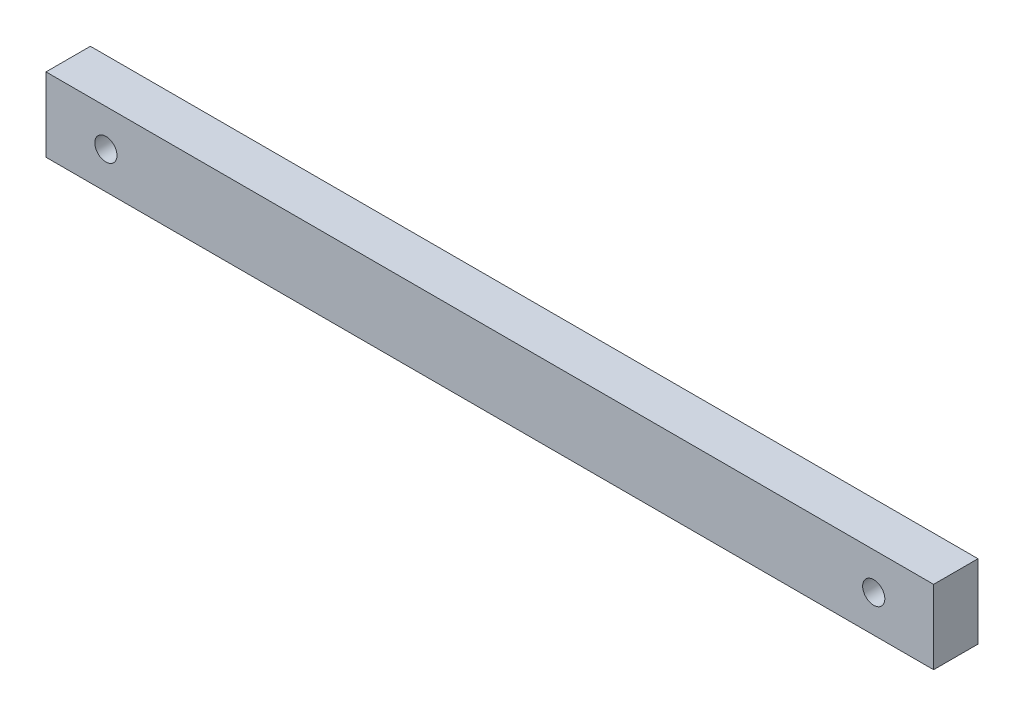
ISO-10303-21;
HEADER;
FILE_DESCRIPTION(('STEP AP214'),'2;1');
FILE_NAME('part.step','',(''),(''),'','','');
FILE_SCHEMA(('AUTOMOTIVE_DESIGN { 1 0 10303 214 1 1 1 1 }'));
ENDSEC;
DATA;
#1=APPLICATION_CONTEXT('core data for automotive mechanical design processes');
#2=APPLICATION_PROTOCOL_DEFINITION('international standard','automotive_design',2000,#1);
#3=PRODUCT_CONTEXT('',#1,'mechanical');
#4=PRODUCT('Part','Part','',(#3));
#5=PRODUCT_RELATED_PRODUCT_CATEGORY('part','',(#4));
#6=PRODUCT_DEFINITION_FORMATION('','',#4);
#7=PRODUCT_DEFINITION_CONTEXT('part definition',#1,'design');
#8=PRODUCT_DEFINITION('design','',#6,#7);
#9=PRODUCT_DEFINITION_SHAPE('','',#8);
#10=(LENGTH_UNIT() NAMED_UNIT(*) SI_UNIT(.MILLI.,.METRE.));
#11=(NAMED_UNIT(*) PLANE_ANGLE_UNIT() SI_UNIT($,.RADIAN.));
#12=(NAMED_UNIT(*) SI_UNIT($,.STERADIAN.) SOLID_ANGLE_UNIT());
#13=UNCERTAINTY_MEASURE_WITH_UNIT(LENGTH_MEASURE(1.E-05),#10,'distance_accuracy_value','');
#14=(GEOMETRIC_REPRESENTATION_CONTEXT(3) GLOBAL_UNCERTAINTY_ASSIGNED_CONTEXT((#13)) GLOBAL_UNIT_ASSIGNED_CONTEXT((#10,
#11,#12)) REPRESENTATION_CONTEXT('',''));
#15=CARTESIAN_POINT('',(0.,0.,0.));
#16=DIRECTION('',(0.,0.,1.));
#17=DIRECTION('',(1.,0.,0.));
#18=AXIS2_PLACEMENT_3D('',#15,#16,#17);
#19=CARTESIAN_POINT('',(0.,0.,6.));
#20=DIRECTION('',(0.,0.,1.));
#21=DIRECTION('',(1.,0.,0.));
#22=AXIS2_PLACEMENT_3D('',#19,#20,#21);
#23=PLANE('',#22);
#24=CARTESIAN_POINT('',(47.6957970958631,15.3206412825651,6.));
#25=DIRECTION('',(0.,0.,-1.));
#26=DIRECTION('',(-1.,0.,0.));
#27=AXIS2_PLACEMENT_3D('',#24,#25,#26);
#28=CIRCLE('',#27,1.5);
#29=CARTESIAN_POINT('',(46.1957970958631,15.3206412825651,6.));
#30=VERTEX_POINT('',#29);
#31=EDGE_CURVE('E134',#30,#30,#28,.T.);
#32=ORIENTED_EDGE('',*,*,#31,.T.);
#33=EDGE_LOOP('',(#32));
#34=FACE_BOUND('',#33,.T.);
#35=DIRECTION('',(0.,-1.,0.));
#36=VECTOR('',#35,1.);
#37=CARTESIAN_POINT('',(-64.2084168336673,20.3206412825651,6.));
#38=LINE('',#37,#36);
#39=CARTESIAN_POINT('',(-64.2084168336673,20.3206412825651,6.));
#40=VERTEX_POINT('',#39);
#41=CARTESIAN_POINT('',(-64.2084168336673,10.3206412825651,6.));
#42=VERTEX_POINT('',#41);
#43=EDGE_CURVE('E92',#40,#42,#38,.T.);
#44=ORIENTED_EDGE('',*,*,#43,.T.);
#45=DIRECTION('',(1.,0.,0.));
#46=VECTOR('',#45,1.);
#47=CARTESIAN_POINT('',(-64.2084168336673,10.3206412825651,6.));
#48=LINE('',#47,#46);
#49=CARTESIAN_POINT('',(55.7915831663327,10.3206412825651,6.));
#50=VERTEX_POINT('',#49);
#51=EDGE_CURVE('E87',#42,#50,#48,.T.);
#52=ORIENTED_EDGE('',*,*,#51,.T.);
#53=DIRECTION('',(0.,1.,0.));
#54=VECTOR('',#53,1.);
#55=CARTESIAN_POINT('',(55.7915831663327,20.3206412825651,6.));
#56=LINE('',#55,#54);
#57=CARTESIAN_POINT('',(55.7915831663327,20.3206412825651,6.));
#58=VERTEX_POINT('',#57);
#59=EDGE_CURVE('E90',#50,#58,#56,.T.);
#60=ORIENTED_EDGE('',*,*,#59,.T.);
#61=DIRECTION('',(-1.,0.,0.));
#62=VECTOR('',#61,1.);
#63=CARTESIAN_POINT('',(-64.2084168336673,20.3206412825651,6.));
#64=LINE('',#63,#62);
#65=EDGE_CURVE('E57',#58,#40,#64,.T.);
#66=ORIENTED_EDGE('',*,*,#65,.T.);
#67=EDGE_LOOP('',(#44,#52,#60,#66));
#68=FACE_BOUND('',#67,.T.);
#69=CARTESIAN_POINT('',(-56.1126307631977,15.3206412825651,6.));
#70=DIRECTION('',(0.,0.,1.));
#71=DIRECTION('',(1.,0.,0.));
#72=AXIS2_PLACEMENT_3D('',#69,#70,#71);
#73=CIRCLE('',#72,1.5);
#74=CARTESIAN_POINT('',(-54.6126307631977,15.3206412825651,6.));
#75=VERTEX_POINT('',#74);
#76=EDGE_CURVE('E138',#75,#75,#73,.T.);
#77=ORIENTED_EDGE('',*,*,#76,.F.);
#78=EDGE_LOOP('',(#77));
#79=FACE_BOUND('',#78,.T.);
#80=ADVANCED_FACE('F39',(#34,#68,#79),#23,.T.);
#81=CARTESIAN_POINT('',(0.,0.,0.));
#82=DIRECTION('',(0.,0.,1.));
#83=DIRECTION('',(1.,0.,0.));
#84=AXIS2_PLACEMENT_3D('',#81,#82,#83);
#85=PLANE('',#84);
#86=DIRECTION('',(0.,-1.,0.));
#87=VECTOR('',#86,1.);
#88=CARTESIAN_POINT('',(-64.2084168336673,20.3206412825651,0.));
#89=LINE('',#88,#87);
#90=CARTESIAN_POINT('',(-64.2084168336673,20.3206412825651,0.));
#91=VERTEX_POINT('',#90);
#92=CARTESIAN_POINT('',(-64.2084168336673,10.3206412825651,0.));
#93=VERTEX_POINT('',#92);
#94=EDGE_CURVE('E108',#91,#93,#89,.T.);
#95=ORIENTED_EDGE('',*,*,#94,.F.);
#96=DIRECTION('',(-1.,0.,0.));
#97=VECTOR('',#96,1.);
#98=CARTESIAN_POINT('',(-64.2084168336673,20.3206412825651,0.));
#99=LINE('',#98,#97);
#100=CARTESIAN_POINT('',(55.7915831663327,20.3206412825651,0.));
#101=VERTEX_POINT('',#100);
#102=EDGE_CURVE('E80',#101,#91,#99,.T.);
#103=ORIENTED_EDGE('',*,*,#102,.F.);
#104=DIRECTION('',(0.,1.,0.));
#105=VECTOR('',#104,1.);
#106=CARTESIAN_POINT('',(55.7915831663327,20.3206412825651,0.));
#107=LINE('',#106,#105);
#108=CARTESIAN_POINT('',(55.7915831663327,10.3206412825651,0.));
#109=VERTEX_POINT('',#108);
#110=EDGE_CURVE('E74',#109,#101,#107,.T.);
#111=ORIENTED_EDGE('',*,*,#110,.F.);
#112=DIRECTION('',(1.,0.,0.));
#113=VECTOR('',#112,1.);
#114=CARTESIAN_POINT('',(-64.2084168336673,10.3206412825651,0.));
#115=LINE('',#114,#113);
#116=EDGE_CURVE('E97',#93,#109,#115,.T.);
#117=ORIENTED_EDGE('',*,*,#116,.F.);
#118=EDGE_LOOP('',(#95,#103,#111,#117));
#119=FACE_BOUND('',#118,.T.);
#120=CARTESIAN_POINT('',(47.6957970958631,15.3206412825651,0.));
#121=DIRECTION('',(0.,0.,-1.));
#122=DIRECTION('',(-1.,0.,0.));
#123=AXIS2_PLACEMENT_3D('',#120,#121,#122);
#124=CIRCLE('',#123,1.5);
#125=CARTESIAN_POINT('',(46.1957970958631,15.3206412825651,0.));
#126=VERTEX_POINT('',#125);
#127=EDGE_CURVE('E130',#126,#126,#124,.T.);
#128=ORIENTED_EDGE('',*,*,#127,.F.);
#129=EDGE_LOOP('',(#128));
#130=FACE_BOUND('',#129,.T.);
#131=CARTESIAN_POINT('',(-56.1126307631977,15.3206412825651,0.));
#132=DIRECTION('',(0.,0.,1.));
#133=DIRECTION('',(1.,0.,0.));
#134=AXIS2_PLACEMENT_3D('',#131,#132,#133);
#135=CIRCLE('',#134,1.5);
#136=CARTESIAN_POINT('',(-54.6126307631977,15.3206412825651,0.));
#137=VERTEX_POINT('',#136);
#138=EDGE_CURVE('E112',#137,#137,#135,.T.);
#139=ORIENTED_EDGE('',*,*,#138,.T.);
#140=EDGE_LOOP('',(#139));
#141=FACE_BOUND('',#140,.T.);
#142=ADVANCED_FACE('F125',(#119,#130,#141),#85,.F.);
#143=CARTESIAN_POINT('',(-64.2084168336673,20.3206412825651,6.));
#144=DIRECTION('',(1.,0.,0.));
#145=DIRECTION('',(0.,0.,-1.));
#146=AXIS2_PLACEMENT_3D('',#143,#144,#145);
#147=PLANE('',#146);
#148=ORIENTED_EDGE('',*,*,#94,.T.);
#149=DIRECTION('',(0.,0.,-1.));
#150=VECTOR('',#149,1.);
#151=CARTESIAN_POINT('',(-64.2084168336673,10.3206412825651,6.));
#152=LINE('',#151,#150);
#153=EDGE_CURVE('E11',#42,#93,#152,.T.);
#154=ORIENTED_EDGE('',*,*,#153,.F.);
#155=ORIENTED_EDGE('',*,*,#43,.F.);
#156=DIRECTION('',(0.,0.,-1.));
#157=VECTOR('',#156,1.);
#158=CARTESIAN_POINT('',(-64.2084168336673,20.3206412825651,6.));
#159=LINE('',#158,#157);
#160=EDGE_CURVE('E104',#40,#91,#159,.T.);
#161=ORIENTED_EDGE('',*,*,#160,.T.);
#162=EDGE_LOOP('',(#148,#154,#155,#161));
#163=FACE_BOUND('',#162,.T.);
#164=ADVANCED_FACE('F41',(#163),#147,.F.);
#165=CARTESIAN_POINT('',(-64.2084168336673,10.3206412825651,6.));
#166=DIRECTION('',(0.,1.,0.));
#167=DIRECTION('',(0.,0.,1.));
#168=AXIS2_PLACEMENT_3D('',#165,#166,#167);
#169=PLANE('',#168);
#170=ORIENTED_EDGE('',*,*,#116,.T.);
#171=DIRECTION('',(0.,0.,-1.));
#172=VECTOR('',#171,1.);
#173=CARTESIAN_POINT('',(55.7915831663327,10.3206412825651,6.));
#174=LINE('',#173,#172);
#175=EDGE_CURVE('E49',#50,#109,#174,.T.);
#176=ORIENTED_EDGE('',*,*,#175,.F.);
#177=ORIENTED_EDGE('',*,*,#51,.F.);
#178=ORIENTED_EDGE('',*,*,#153,.T.);
#179=EDGE_LOOP('',(#170,#176,#177,#178));
#180=FACE_BOUND('',#179,.T.);
#181=ADVANCED_FACE('F96',(#180),#169,.F.);
#182=CARTESIAN_POINT('',(55.7915831663327,20.3206412825651,6.));
#183=DIRECTION('',(-1.,0.,0.));
#184=DIRECTION('',(0.,0.,1.));
#185=AXIS2_PLACEMENT_3D('',#182,#183,#184);
#186=PLANE('',#185);
#187=ORIENTED_EDGE('',*,*,#110,.T.);
#188=DIRECTION('',(0.,0.,-1.));
#189=VECTOR('',#188,1.);
#190=CARTESIAN_POINT('',(55.7915831663327,20.3206412825651,6.));
#191=LINE('',#190,#189);
#192=EDGE_CURVE('E99',#58,#101,#191,.T.);
#193=ORIENTED_EDGE('',*,*,#192,.F.);
#194=ORIENTED_EDGE('',*,*,#59,.F.);
#195=ORIENTED_EDGE('',*,*,#175,.T.);
#196=EDGE_LOOP('',(#187,#193,#194,#195));
#197=FACE_BOUND('',#196,.T.);
#198=ADVANCED_FACE('F100',(#197),#186,.F.);
#199=CARTESIAN_POINT('',(-64.2084168336673,20.3206412825651,6.));
#200=DIRECTION('',(0.,-1.,0.));
#201=DIRECTION('',(0.,0.,-1.));
#202=AXIS2_PLACEMENT_3D('',#199,#200,#201);
#203=PLANE('',#202);
#204=ORIENTED_EDGE('',*,*,#102,.T.);
#205=ORIENTED_EDGE('',*,*,#160,.F.);
#206=ORIENTED_EDGE('',*,*,#65,.F.);
#207=ORIENTED_EDGE('',*,*,#192,.T.);
#208=EDGE_LOOP('',(#204,#205,#206,#207));
#209=FACE_BOUND('',#208,.T.);
#210=ADVANCED_FACE('F122',(#209),#203,.F.);
#211=CARTESIAN_POINT('',(47.6957970958631,15.3206412825651,0.));
#212=DIRECTION('',(0.,0.,1.));
#213=DIRECTION('',(1.,0.,0.));
#214=AXIS2_PLACEMENT_3D('',#211,#212,#213);
#215=CYLINDRICAL_SURFACE('',#214,1.5);
#216=ORIENTED_EDGE('',*,*,#127,.T.);
#217=EDGE_LOOP('',(#216));
#218=FACE_BOUND('',#217,.T.);
#219=ORIENTED_EDGE('',*,*,#31,.F.);
#220=EDGE_LOOP('',(#219));
#221=FACE_BOUND('',#220,.T.);
#222=ADVANCED_FACE('F150',(#218,#221),#215,.F.);
#223=CARTESIAN_POINT('',(-56.1126307631977,15.3206412825651,0.));
#224=DIRECTION('',(0.,0.,1.));
#225=DIRECTION('',(1.,0.,0.));
#226=AXIS2_PLACEMENT_3D('',#223,#224,#225);
#227=CYLINDRICAL_SURFACE('',#226,1.5);
#228=ORIENTED_EDGE('',*,*,#138,.F.);
#229=EDGE_LOOP('',(#228));
#230=FACE_BOUND('',#229,.T.);
#231=ORIENTED_EDGE('',*,*,#76,.T.);
#232=EDGE_LOOP('',(#231));
#233=FACE_BOUND('',#232,.T.);
#234=ADVANCED_FACE('F147',(#230,#233),#227,.F.);
#235=CLOSED_SHELL('',(#80,#142,#164,#181,#198,#210,#222,#234));
#236=MANIFOLD_SOLID_BREP('B2',#235);
#237=ADVANCED_BREP_SHAPE_REPRESENTATION('',(#18,#236),#14);
#238=SHAPE_DEFINITION_REPRESENTATION(#9,#237);
ENDSEC;
END-ISO-10303-21;
